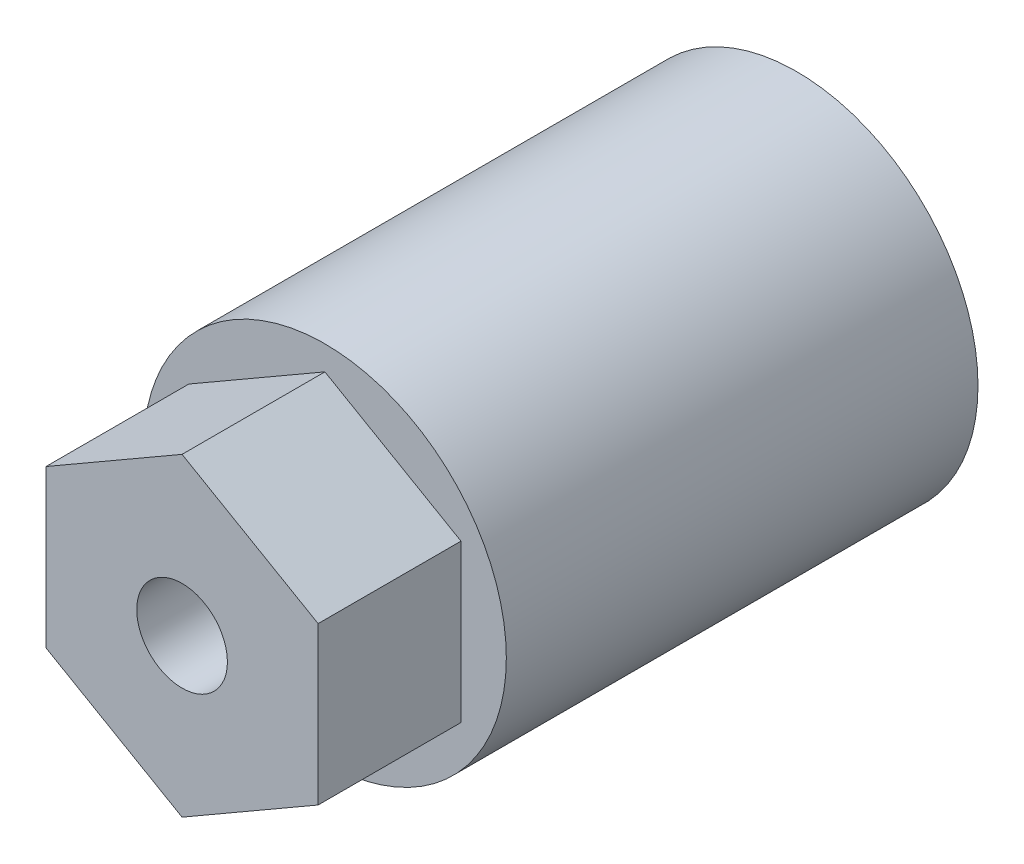
ISO-10303-21;
HEADER;
FILE_DESCRIPTION(('STEP AP214'),'2;1');
FILE_NAME('part.step','',(''),(''),'','','');
FILE_SCHEMA(('AUTOMOTIVE_DESIGN { 1 0 10303 214 1 1 1 1 }'));
ENDSEC;
DATA;
#1=APPLICATION_CONTEXT('core data for automotive mechanical design processes');
#2=APPLICATION_PROTOCOL_DEFINITION('international standard','automotive_design',2000,#1);
#3=PRODUCT_CONTEXT('',#1,'mechanical');
#4=PRODUCT('Part','Part','',(#3));
#5=PRODUCT_RELATED_PRODUCT_CATEGORY('part','',(#4));
#6=PRODUCT_DEFINITION_FORMATION('','',#4);
#7=PRODUCT_DEFINITION_CONTEXT('part definition',#1,'design');
#8=PRODUCT_DEFINITION('design','',#6,#7);
#9=PRODUCT_DEFINITION_SHAPE('','',#8);
#10=(LENGTH_UNIT() NAMED_UNIT(*) SI_UNIT(.MILLI.,.METRE.));
#11=(NAMED_UNIT(*) PLANE_ANGLE_UNIT() SI_UNIT($,.RADIAN.));
#12=(NAMED_UNIT(*) SI_UNIT($,.STERADIAN.) SOLID_ANGLE_UNIT());
#13=UNCERTAINTY_MEASURE_WITH_UNIT(LENGTH_MEASURE(1.E-05),#10,'distance_accuracy_value','');
#14=(GEOMETRIC_REPRESENTATION_CONTEXT(3) GLOBAL_UNCERTAINTY_ASSIGNED_CONTEXT((#13)) GLOBAL_UNIT_ASSIGNED_CONTEXT((#10,
#11,#12)) REPRESENTATION_CONTEXT('',''));
#15=CARTESIAN_POINT('',(0.,0.,0.));
#16=DIRECTION('',(0.,0.,1.));
#17=DIRECTION('',(1.,0.,0.));
#18=AXIS2_PLACEMENT_3D('',#15,#16,#17);
#19=CARTESIAN_POINT('',(0.,0.,20.8));
#20=DIRECTION('',(0.,0.,1.));
#21=DIRECTION('',(1.,0.,0.));
#22=AXIS2_PLACEMENT_3D('',#19,#20,#21);
#23=PLANE('',#22);
#24=CARTESIAN_POINT('',(0.,0.,20.8));
#25=DIRECTION('',(0.,0.,1.));
#26=DIRECTION('',(1.,0.,0.));
#27=AXIS2_PLACEMENT_3D('',#24,#25,#26);
#28=CIRCLE('',#27,8.);
#29=CARTESIAN_POINT('',(8.,0.,20.8));
#30=VERTEX_POINT('',#29);
#31=EDGE_CURVE('E11',#30,#30,#28,.T.);
#32=ORIENTED_EDGE('',*,*,#31,.T.);
#33=EDGE_LOOP('',(#32));
#34=FACE_BOUND('',#33,.T.);
#35=DIRECTION('',(-0.866025403784439,-0.5,0.));
#36=VECTOR('',#35,1.);
#37=CARTESIAN_POINT('',(0.,6.92820323027551,20.8));
#38=LINE('',#37,#36);
#39=CARTESIAN_POINT('',(0.,6.92820323027551,20.8));
#40=VERTEX_POINT('',#39);
#41=CARTESIAN_POINT('',(-6.,3.46410161513776,20.8));
#42=VERTEX_POINT('',#41);
#43=EDGE_CURVE('E118',#40,#42,#38,.T.);
#44=ORIENTED_EDGE('',*,*,#43,.F.);
#45=DIRECTION('',(-0.866025403784439,0.5,0.));
#46=VECTOR('',#45,1.);
#47=CARTESIAN_POINT('',(6.,3.46410161513776,20.8));
#48=LINE('',#47,#46);
#49=CARTESIAN_POINT('',(6.,3.46410161513776,20.8));
#50=VERTEX_POINT('',#49);
#51=EDGE_CURVE('E115',#50,#40,#48,.T.);
#52=ORIENTED_EDGE('',*,*,#51,.F.);
#53=DIRECTION('',(0.,1.,0.));
#54=VECTOR('',#53,1.);
#55=CARTESIAN_POINT('',(6.,-3.46410161513775,20.8));
#56=LINE('',#55,#54);
#57=CARTESIAN_POINT('',(6.,-3.46410161513775,20.8));
#58=VERTEX_POINT('',#57);
#59=EDGE_CURVE('E73',#58,#50,#56,.T.);
#60=ORIENTED_EDGE('',*,*,#59,.F.);
#61=DIRECTION('',(0.866025403784439,0.5,0.));
#62=VECTOR('',#61,1.);
#63=CARTESIAN_POINT('',(0.,-6.92820323027551,20.8));
#64=LINE('',#63,#62);
#65=CARTESIAN_POINT('',(0.,-6.92820323027551,20.8));
#66=VERTEX_POINT('',#65);
#67=EDGE_CURVE('E124',#66,#58,#64,.T.);
#68=ORIENTED_EDGE('',*,*,#67,.F.);
#69=DIRECTION('',(0.866025403784439,-0.5,0.));
#70=VECTOR('',#69,1.);
#71=CARTESIAN_POINT('',(-6.,-3.46410161513775,20.8));
#72=LINE('',#71,#70);
#73=CARTESIAN_POINT('',(-6.,-3.46410161513775,20.8));
#74=VERTEX_POINT('',#73);
#75=EDGE_CURVE('E104',#74,#66,#72,.T.);
#76=ORIENTED_EDGE('',*,*,#75,.F.);
#77=DIRECTION('',(0.,-1.,0.));
#78=VECTOR('',#77,1.);
#79=CARTESIAN_POINT('',(-6.,3.46410161513776,20.8));
#80=LINE('',#79,#78);
#81=EDGE_CURVE('E121',#42,#74,#80,.T.);
#82=ORIENTED_EDGE('',*,*,#81,.F.);
#83=EDGE_LOOP('',(#44,#52,#60,#68,#76,#82));
#84=FACE_BOUND('',#83,.T.);
#85=ADVANCED_FACE('F30',(#34,#84),#23,.T.);
#86=CARTESIAN_POINT('',(0.,0.,20.8));
#87=DIRECTION('',(0.,0.,-1.));
#88=DIRECTION('',(-1.,0.,0.));
#89=AXIS2_PLACEMENT_3D('',#86,#87,#88);
#90=CYLINDRICAL_SURFACE('',#89,3.1);
#91=CARTESIAN_POINT('',(-3.1,0.,3.5));
#92=CARTESIAN_POINT('',(-3.09999001335381,-0.119778360676659,3.50001028148365));
#93=CARTESIAN_POINT('',(-3.09298899770045,-0.239689539985006,3.50867740049262));
#94=CARTESIAN_POINT('',(-3.06560951820483,-0.475617759933917,3.54275354772049));
#95=CARTESIAN_POINT('',(-3.04520791212676,-0.591627698312463,3.56819153878806));
#96=CARTESIAN_POINT('',(-2.9929494019227,-0.815730353912269,3.63396063484863));
#97=CARTESIAN_POINT('',(-2.96116388784221,-0.923867467554761,3.67419896641728));
#98=CARTESIAN_POINT('',(-2.88841373293041,-1.13099059708294,3.76756032693233));
#99=CARTESIAN_POINT('',(-2.84744794143697,-1.22997546362095,3.82068497112667));
#100=CARTESIAN_POINT('',(-2.74309892139905,-1.45090450952975,3.95860328742459));
#101=CARTESIAN_POINT('',(-2.67690087487705,-1.56866360440175,4.04796183868125));
#102=CARTESIAN_POINT('',(-2.53775821079263,-1.7850404255772,4.24357894520806));
#103=CARTESIAN_POINT('',(-2.46479460442876,-1.88360171240231,4.34988570870426));
#104=CARTESIAN_POINT('',(-2.35456527658012,-2.017286965089,4.52151631947274));
#105=CARTESIAN_POINT('',(-2.31738149085423,-2.05977934340619,4.58129992553594));
#106=CARTESIAN_POINT('',(-2.24389548090978,-2.13959589417189,4.70480110486757));
#107=CARTESIAN_POINT('',(-2.20759354335433,-2.17691840410622,4.76851993413571));
#108=CARTESIAN_POINT('',(-2.13716872606198,-2.24609423898418,4.89975126501393));
#109=CARTESIAN_POINT('',(-2.10304023438918,-2.27796204037355,4.96725307355054));
#110=CARTESIAN_POINT('',(-2.03837958481211,-2.33599958602125,5.10625838105639));
#111=CARTESIAN_POINT('',(-2.00784434920913,-2.36217422314001,5.17775837689831));
#112=CARTESIAN_POINT('',(-1.94837498628516,-2.41154065035239,5.33504336983782));
#113=CARTESIAN_POINT('',(-1.92024755256826,-2.43381803587642,5.42143574444143));
#114=CARTESIAN_POINT('',(-1.87451159448019,-2.46922213667887,5.59866772098612));
#115=CARTESIAN_POINT('',(-1.85687697622378,-2.48237156536743,5.68949567787761));
#116=CARTESIAN_POINT('',(-1.83500569313484,-2.49859247783835,5.87461738874309));
#117=CARTESIAN_POINT('',(-1.83089546359108,-2.50156886697938,5.96893555887658));
#118=CARTESIAN_POINT('',(-1.83732153085888,-2.49684928962182,6.1568259440256));
#119=CARTESIAN_POINT('',(-1.84786859391861,-2.48914547818581,6.25039755988168));
#120=CARTESIAN_POINT('',(-1.88391546736506,-2.46199489218825,6.44702234195062));
#121=CARTESIAN_POINT('',(-1.91135892816041,-2.44100955585001,6.54948705969592));
#122=CARTESIAN_POINT('',(-1.97745021574095,-2.38777531233997,6.74775503009025));
#123=CARTESIAN_POINT('',(-2.01613187508474,-2.35549233272118,6.84353706850858));
#124=CARTESIAN_POINT('',(-2.08976487157298,-2.29012853184197,7.00546278977321));
#125=CARTESIAN_POINT('',(-2.12332131477706,-2.25916672321896,7.0731333329522));
#126=CARTESIAN_POINT('',(-2.19268911692417,-2.19190662653042,7.20457297739353));
#127=CARTESIAN_POINT('',(-2.22850156493576,-2.15560574960943,7.26834016459819));
#128=CARTESIAN_POINT('',(-2.3375286609731,-2.03893319943357,7.45401664591901));
#129=CARTESIAN_POINT('',(-2.41230832480796,-1.95081223232775,7.57025070756857));
#130=CARTESIAN_POINT('',(-2.56083494886911,-1.75160111169682,7.79012948722995));
#131=CARTESIAN_POINT('',(-2.63448052560473,-1.63989136012433,7.89328097039917));
#132=CARTESIAN_POINT('',(-2.77154829394836,-1.39570626530501,8.0797717240555));
#133=CARTESIAN_POINT('',(-2.83499703716061,-1.26328668498952,8.16316272708942));
#134=CARTESIAN_POINT('',(-2.92949524106006,-1.01979463227478,8.28538194470123));
#135=CARTESIAN_POINT('',(-2.96463246261837,-0.913281538338363,8.33014295899967));
#136=CARTESIAN_POINT('',(-3.02386567643609,-0.692299383436477,8.40505608152619));
#137=CARTESIAN_POINT('',(-3.04796987506065,-0.577836308895644,8.43521904874611));
#138=CARTESIAN_POINT('',(-3.08324545183139,-0.34314084571492,8.47922918050984));
#139=CARTESIAN_POINT('',(-3.09434390591335,-0.222879825409671,8.49298435310288));
#140=CARTESIAN_POINT('',(-3.1022974998994,0.0188325356493559,8.50285038306527));
#141=CARTESIAN_POINT('',(-3.09915629445998,0.140283562999878,8.49896576774505));
#142=CARTESIAN_POINT('',(-3.07985111492542,0.369592159693093,8.47497973113724));
#143=CARTESIAN_POINT('',(-3.06485327605492,0.477707829230698,8.45633025016811));
#144=CARTESIAN_POINT('',(-3.02443626838147,0.688719557586174,8.4057112095014));
#145=CARTESIAN_POINT('',(-2.99901424030674,0.791614175602715,8.37373799517109));
#146=CARTESIAN_POINT('',(-2.93781657584416,0.995582572846002,8.29594741604706));
#147=CARTESIAN_POINT('',(-2.90155557352613,1.09625730275886,8.24947515235124));
#148=CARTESIAN_POINT('',(-2.82155077559663,1.28828745868955,8.14528835497947));
#149=CARTESIAN_POINT('',(-2.77780631007413,1.37964204920942,8.08757281475407));
#150=CARTESIAN_POINT('',(-2.67639841656326,1.5685751007912,7.95079494403796));
#151=CARTESIAN_POINT('',(-2.6176603588023,1.66413998612004,7.86975889351471));
#152=CARTESIAN_POINT('',(-2.49626806764123,1.84124673515975,7.69566732695565));
#153=CARTESIAN_POINT('',(-2.43360410084937,1.92275170041104,7.602581273822));
#154=CARTESIAN_POINT('',(-2.33292149755606,2.0423019501302,7.44383811487991));
#155=CARTESIAN_POINT('',(-2.2948094629046,2.0849103113265,7.3816180351288));
#156=CARTESIAN_POINT('',(-2.21975309444715,2.1646455380106,7.25301193659697));
#157=CARTESIAN_POINT('',(-2.18280935479017,2.2017696485683,7.18662384777934));
#158=CARTESIAN_POINT('',(-2.11156599968842,2.27018074659443,7.04981522138375));
#159=CARTESIAN_POINT('',(-2.07725930257227,2.30148371250482,6.97940643691333));
#160=CARTESIAN_POINT('',(-2.01293979676536,2.35794450749181,6.83435448256897));
#161=CARTESIAN_POINT('',(-1.98292225025443,2.38310913908663,6.75971611405686));
#162=CARTESIAN_POINT('',(-1.92703802029426,2.42856624200181,6.59963108295032));
#163=CARTESIAN_POINT('',(-1.90174280150121,2.44826102065036,6.51380533858212));
#164=CARTESIAN_POINT('',(-1.86203047167624,2.47860518959247,6.33824484581172));
#165=CARTESIAN_POINT('',(-1.84758432915324,2.48927872987158,6.24852121431641));
#166=CARTESIAN_POINT('',(-1.83198973066466,2.50078489626993,6.0665425174808));
#167=CARTESIAN_POINT('',(-1.83094108349744,2.50154366013723,5.9742735782176));
#168=CARTESIAN_POINT('',(-1.84262322053153,2.49294583035613,5.79104623753692));
#169=CARTESIAN_POINT('',(-1.8553712786061,2.48357655612899,5.70008962382471));
#170=CARTESIAN_POINT('',(-1.89618640153277,2.45259921802398,5.50333197602627));
#171=CARTESIAN_POINT('',(-1.92691938765144,2.42882492610552,5.39845101442106));
#172=CARTESIAN_POINT('',(-1.99936028699355,2.36954227385472,5.19596278042123));
#173=CARTESIAN_POINT('',(-2.04110111187003,2.33399864225652,5.09837846606305));
#174=CARTESIAN_POINT('',(-2.11940167638023,2.26278696499334,4.93433183973946));
#175=CARTESIAN_POINT('',(-2.15463003859835,2.22939184189949,4.86620821230552));
#176=CARTESIAN_POINT('',(-2.22703059559933,2.15707029651434,4.73401056571578));
#177=CARTESIAN_POINT('',(-2.26420367592479,2.1181413402474,4.66993842128609));
#178=CARTESIAN_POINT('',(-2.33930273605632,2.03489715163424,4.54577149290103));
#179=CARTESIAN_POINT('',(-2.37722927468899,1.99057778625372,4.48567981614638));
#180=CARTESIAN_POINT('',(-2.45281816939318,1.89666309949984,4.36958517047597));
#181=CARTESIAN_POINT('',(-2.49048037968546,1.84706507852289,4.31358431861243));
#182=CARTESIAN_POINT('',(-2.60338878677403,1.68802975013425,4.14957914374343));
#183=CARTESIAN_POINT('',(-2.67689336802577,1.57010426927428,4.04820966851992));
#184=CARTESIAN_POINT('',(-2.77806294552149,1.37755009978862,3.91229408369595));
#185=CARTESIAN_POINT('',(-2.81025494891813,1.31079924420425,3.86969944245975));
#186=CARTESIAN_POINT('',(-2.87080763913606,1.17224885881743,3.79043049934866));
#187=CARTESIAN_POINT('',(-2.89917040151468,1.10045209639154,3.75375298810251));
#188=CARTESIAN_POINT('',(-2.96115028124245,0.923785635516078,3.67422084599394));
#189=CARTESIAN_POINT('',(-2.99262693015815,0.816770664538932,3.63437042748585));
#190=CARTESIAN_POINT('',(-3.04428396421388,0.59592432288367,3.56935048078989));
#191=CARTESIAN_POINT('',(-3.06449047589921,0.482109400389084,3.54414699219844));
#192=CARTESIAN_POINT('',(-3.08545620159964,0.306066119073141,3.51805233135377));
#193=CARTESIAN_POINT('',(-3.09089438398327,0.245195500229957,3.51129842402836));
#194=CARTESIAN_POINT('',(-3.09816930782587,0.12289500560308,3.5022690454876));
#195=CARTESIAN_POINT('',(-3.1000051247079,0.0614649903089401,3.49999472399447));
#196=CARTESIAN_POINT('',(-3.1,0.,3.5));
#197=B_SPLINE_CURVE_WITH_KNOTS('',3,(#91,#92,#93,#94,#95,#96,#97,#98,#99,#100,#101,#102,#103,
#104,#105,#106,#107,#108,#109,#110,#111,#112,#113,#114,#115,#116,#117,#118,#119,#120,#121,#122,
#123,#124,#125,#126,#127,#128,#129,#130,#131,#132,#133,#134,#135,#136,#137,#138,#139,#140,#141,
#142,#143,#144,#145,#146,#147,#148,#149,#150,#151,#152,#153,#154,#155,#156,#157,#158,#159,#160,
#161,#162,#163,#164,#165,#166,#167,#168,#169,#170,#171,#172,#173,#174,#175,#176,#177,#178,#179,
#180,#181,#182,#183,#184,#185,#186,#187,#188,#189,#190,#191,#192,#193,#194,#195,#196),
.UNSPECIFIED.,.T.,.F.,(4,2,2,2,2,2,2,2,2,2,2,2,2,2,2,2,2,2,2,2,2,2,2,2,2,2,2,2,2,2,2,2,2,2,2,2,
2,2,2,2,2,2,2,2,2,2,2,2,2,2,2,2,4),(0.,0.359070623022655,0.718762981506723,1.07623806013682,
1.43375797001857,1.91714127370146,2.40192490534894,2.64841768811481,2.89498955433995,
3.14089653182535,3.38659132770226,3.66629544495804,3.94530104553679,4.22690768112856,
4.50872127512767,4.83133279215932,5.15492577621902,5.39951634126531,5.64422589899106,
6.1338217571336,6.63837846963134,7.14159929676523,7.50245315539382,7.86303817292729,
8.22563548450796,8.58813973953903,8.91885561645134,9.24966226683066,9.59834994649167,
9.94706885662276,10.3607838797144,10.7755686514586,11.028808623269,11.2821753768965,
11.5348360542378,11.7872154471329,12.0610951823722,12.3342393942177,12.6094173021897,
12.8849401398458,13.2186306545198,13.5533303889098,13.8039756020852,14.0547359591548,
14.305689810481,14.5567726267162,15.0695565026576,15.3256405009352,15.5815851323227,
15.9354380765006,16.2884672690008,16.4726792578371,16.6569385200247),.UNSPECIFIED.);
#198=CARTESIAN_POINT('',(-3.1,0.,3.5));
#199=VERTEX_POINT('',#198);
#200=EDGE_CURVE('E208',#199,#199,#197,.T.);
#201=ORIENTED_EDGE('',*,*,#200,.T.);
#202=EDGE_LOOP('',(#201));
#203=FACE_BOUND('',#202,.T.);
#204=CARTESIAN_POINT('',(0.,0.,0.));
#205=DIRECTION('',(0.,0.,1.));
#206=DIRECTION('',(1.,0.,0.));
#207=AXIS2_PLACEMENT_3D('',#204,#205,#206);
#208=CIRCLE('',#207,3.1);
#209=CARTESIAN_POINT('',(3.1,0.,0.));
#210=VERTEX_POINT('',#209);
#211=EDGE_CURVE('E142',#210,#210,#208,.T.);
#212=ORIENTED_EDGE('',*,*,#211,.F.);
#213=EDGE_LOOP('',(#212));
#214=FACE_BOUND('',#213,.T.);
#215=CARTESIAN_POINT('',(0.,0.,18.6));
#216=DIRECTION('',(0.,0.,1.));
#217=DIRECTION('',(1.,0.,0.));
#218=AXIS2_PLACEMENT_3D('',#215,#216,#217);
#219=CIRCLE('',#218,3.1);
#220=CARTESIAN_POINT('',(3.1,0.,18.6));
#221=VERTEX_POINT('',#220);
#222=EDGE_CURVE('E139',#221,#221,#219,.T.);
#223=ORIENTED_EDGE('',*,*,#222,.T.);
#224=EDGE_LOOP('',(#223));
#225=FACE_BOUND('',#224,.T.);
#226=ADVANCED_FACE('F152',(#203,#214,#225),#90,.F.);
#227=CARTESIAN_POINT('',(0.,0.,0.));
#228=DIRECTION('',(0.,0.,1.));
#229=DIRECTION('',(1.,0.,0.));
#230=AXIS2_PLACEMENT_3D('',#227,#228,#229);
#231=PLANE('',#230);
#232=CARTESIAN_POINT('',(0.,0.,0.));
#233=DIRECTION('',(0.,0.,1.));
#234=DIRECTION('',(1.,0.,0.));
#235=AXIS2_PLACEMENT_3D('',#232,#233,#234);
#236=CIRCLE('',#235,8.);
#237=CARTESIAN_POINT('',(8.,0.,0.));
#238=VERTEX_POINT('',#237);
#239=EDGE_CURVE('E34',#238,#238,#236,.T.);
#240=ORIENTED_EDGE('',*,*,#239,.F.);
#241=EDGE_LOOP('',(#240));
#242=FACE_BOUND('',#241,.T.);
#243=ORIENTED_EDGE('',*,*,#211,.T.);
#244=EDGE_LOOP('',(#243));
#245=FACE_BOUND('',#244,.T.);
#246=ADVANCED_FACE('F150',(#242,#245),#231,.F.);
#247=CARTESIAN_POINT('',(0.,0.,20.8));
#248=DIRECTION('',(0.,0.,-1.));
#249=DIRECTION('',(-1.,0.,0.));
#250=AXIS2_PLACEMENT_3D('',#247,#248,#249);
#251=CYLINDRICAL_SURFACE('',#250,8.);
#252=CARTESIAN_POINT('',(-8.,0.,3.5));
#253=CARTESIAN_POINT('',(-7.9999993175598,-0.136878370349093,3.50000089317515));
#254=CARTESIAN_POINT('',(-7.99645389969682,-0.273766105005719,3.51127845388891));
#255=CARTESIAN_POINT('',(-7.98265788177613,-0.543538419176897,3.55597248307847));
#256=CARTESIAN_POINT('',(-7.97240576399719,-0.676422085451815,3.58939396272872));
#257=CARTESIAN_POINT('',(-7.94631631395819,-0.934257087301613,3.67713874239148));
#258=CARTESIAN_POINT('',(-7.9304876299805,-1.05922035397161,3.73142968930593));
#259=CARTESIAN_POINT('',(-7.89487938322185,-1.29826960469292,3.85923463535666));
#260=CARTESIAN_POINT('',(-7.8750991979981,-1.41235387088977,3.93275166356117));
#261=CARTESIAN_POINT('',(-7.83300427480565,-1.62993066990456,4.09931198403472));
#262=CARTESIAN_POINT('',(-7.81063431853978,-1.73304005631332,4.19284177012214));
#263=CARTESIAN_POINT('',(-7.76620092748417,-1.92239476407399,4.3957367848271));
#264=CARTESIAN_POINT('',(-7.74413755046914,-2.00863694579739,4.5051049549891));
#265=CARTESIAN_POINT('',(-7.70222289396344,-2.16388672966227,4.73988912761617));
#266=CARTESIAN_POINT('',(-7.68243976603591,-2.23241568300258,4.86563495505444));
#267=CARTESIAN_POINT('',(-7.64815603598468,-2.34719482153343,5.12758462996375));
#268=CARTESIAN_POINT('',(-7.63365404257377,-2.39345087543889,5.26378571158786));
#269=CARTESIAN_POINT('',(-7.61215213969001,-2.46096919860067,5.53845615490413));
#270=CARTESIAN_POINT('',(-7.60493945859016,-2.48294220015729,5.67673368727771));
#271=CARTESIAN_POINT('',(-7.59820110281901,-2.50349110073976,5.95518623782379));
#272=CARTESIAN_POINT('',(-7.59867338454668,-2.50207321991544,6.09536074164332));
#273=CARTESIAN_POINT('',(-7.60706378150876,-2.47643649465479,6.36774892053797));
#274=CARTESIAN_POINT('',(-7.61468683491897,-2.45312115738766,6.50005825172313));
#275=CARTESIAN_POINT('',(-7.63604051304978,-2.38581626711252,6.75878431307469));
#276=CARTESIAN_POINT('',(-7.6497717868623,-2.34182451689101,6.8852004154176));
#277=CARTESIAN_POINT('',(-7.68202088028593,-2.23377749362554,7.13070388886527));
#278=CARTESIAN_POINT('',(-7.70060569321649,-2.16943851324164,7.24965722138397));
#279=CARTESIAN_POINT('',(-7.7404371316014,-2.02272041475696,7.47537553575825));
#280=CARTESIAN_POINT('',(-7.76168444789102,-1.94033661043155,7.58213734050743));
#281=CARTESIAN_POINT('',(-7.80563055600986,-1.75543390836425,7.78554988683398));
#282=CARTESIAN_POINT('',(-7.82835139211391,-1.65216914118564,7.88151911555937));
#283=CARTESIAN_POINT('',(-7.87183141519161,-1.43072881619106,8.05494378715936));
#284=CARTESIAN_POINT('',(-7.89259045676745,-1.31255215469804,8.13239785843842));
#285=CARTESIAN_POINT('',(-7.93002589780382,-1.06332922093091,8.26705537720255));
#286=CARTESIAN_POINT('',(-7.94666921296415,-0.932189813838559,8.32409627092794));
#287=CARTESIAN_POINT('',(-7.97375911657108,-0.661535955565289,8.41510600170313));
#288=CARTESIAN_POINT('',(-7.98420758650304,-0.522024061449217,8.44908184447679));
#289=CARTESIAN_POINT('',(-7.99742778790027,-0.24437031458069,8.49183608515796));
#290=CARTESIAN_POINT('',(-8.00048045790873,-0.106383697577686,8.50153708718705));
#291=CARTESIAN_POINT('',(-7.99939599461967,0.169260611465171,8.49806754672534));
#292=CARTESIAN_POINT('',(-7.9952599116227,0.306918348613018,8.48490034535478));
#293=CARTESIAN_POINT('',(-7.98044727539523,0.574438665951697,8.43680881478723));
#294=CARTESIAN_POINT('',(-7.96993586221374,0.704409956841872,8.40243346477503));
#295=CARTESIAN_POINT('',(-7.94360242758579,0.956703857722752,8.31357129526657));
#296=CARTESIAN_POINT('',(-7.92777975028687,1.07902552089812,8.25908199194998));
#297=CARTESIAN_POINT('',(-7.89197085518848,1.31586481334438,8.13005356690263));
#298=CARTESIAN_POINT('',(-7.87189253635335,1.43011947957558,8.05505802500638));
#299=CARTESIAN_POINT('',(-7.82986820006859,1.64473170192052,7.88769357976515));
#300=CARTESIAN_POINT('',(-7.80792167695774,1.7450854760879,7.79531996451072));
#301=CARTESIAN_POINT('',(-7.76353989766283,1.93317492583804,7.5914822198958));
#302=CARTESIAN_POINT('',(-7.74111973412883,2.02025304679062,7.47940667252155));
#303=CARTESIAN_POINT('',(-7.69923894191212,2.17442500490303,7.24174676724645));
#304=CARTESIAN_POINT('',(-7.67977826622621,2.24151915946859,7.11616262394603));
#305=CARTESIAN_POINT('',(-7.64623564661738,2.35340166961084,6.85530965425905));
#306=CARTESIAN_POINT('',(-7.63213292713749,2.39827639112025,6.72008070112856));
#307=CARTESIAN_POINT('',(-7.6110234168862,2.4644578863618,6.44345501350276));
#308=CARTESIAN_POINT('',(-7.60401392602456,2.48577362827989,6.30206064731293));
#309=CARTESIAN_POINT('',(-7.59816585427753,2.50358812316251,6.02399182483914));
#310=CARTESIAN_POINT('',(-7.59897209200284,2.50116559243271,5.88739309230516));
#311=CARTESIAN_POINT('',(-7.60780180751807,2.47417636257668,5.61665083011612));
#312=CARTESIAN_POINT('',(-7.61582494863208,2.44961069645024,5.48250718622653));
#313=CARTESIAN_POINT('',(-7.6379362836678,2.37975459827235,5.22241192081622));
#314=CARTESIAN_POINT('',(-7.65193396380513,2.33477284812016,5.09636911781328));
#315=CARTESIAN_POINT('',(-7.68439408509128,2.22560454669999,4.85351917293199));
#316=CARTESIAN_POINT('',(-7.70285743429343,2.16141408888474,4.73671391584319));
#317=CARTESIAN_POINT('',(-7.74306974067005,2.01271350026986,4.51070805912037));
#318=CARTESIAN_POINT('',(-7.76491897845913,1.92750667048265,4.40198374099952));
#319=CARTESIAN_POINT('',(-7.8089799764242,1.7404179928096,4.200027343776));
#320=CARTESIAN_POINT('',(-7.83119183213309,1.63853168468878,4.10679942201788));
#321=CARTESIAN_POINT('',(-7.87434543904947,1.41697332564669,3.93543492327414));
#322=CARTESIAN_POINT('',(-7.89522203461345,1.29682914897477,3.8578905271001));
#323=CARTESIAN_POINT('',(-7.93253538593756,1.0445582760273,3.72420216972109));
#324=CARTESIAN_POINT('',(-7.94897388631644,0.912436315590896,3.66804979571633));
#325=CARTESIAN_POINT('',(-7.97441301466941,0.651495270747956,3.58281726478307));
#326=CARTESIAN_POINT('',(-7.98392481612283,0.523340674225092,3.55185026538933));
#327=CARTESIAN_POINT('',(-7.99671800680967,0.263459790880495,3.51044328006457));
#328=CARTESIAN_POINT('',(-8.00000065679286,0.131734232279349,3.49999914039199));
#329=CARTESIAN_POINT('',(-8.,0.,3.5));
#330=B_SPLINE_CURVE_WITH_KNOTS('',3,(#252,#253,#254,#255,#256,#257,#258,#259,#260,#261,#262,
#263,#264,#265,#266,#267,#268,#269,#270,#271,#272,#273,#274,#275,#276,#277,#278,#279,#280,#281,
#282,#283,#284,#285,#286,#287,#288,#289,#290,#291,#292,#293,#294,#295,#296,#297,#298,#299,#300,
#301,#302,#303,#304,#305,#306,#307,#308,#309,#310,#311,#312,#313,#314,#315,#316,#317,#318,#319,
#320,#321,#322,#323,#324,#325,#326,#327,#328,#329),.UNSPECIFIED.,.T.,.F.,(4,2,2,2,2,2,2,2,2,2,2,
2,2,2,2,2,2,2,2,2,2,2,2,2,2,2,2,2,2,2,2,2,2,2,2,2,2,2,4),(0.,0.41015089886502,0.820394646698133,
1.23000495840487,1.63967984311678,2.06075644390317,2.48191134862552,2.91347542494988,
3.34492572559054,3.7633830033442,4.18172900590277,4.58353834844338,4.98539039958126,
5.3931128544109,5.80094132020717,6.227334945592,6.65376014826606,7.0835092137954,
7.51312768989108,7.92615137096475,8.33911471298726,8.74181253445744,9.14456010068999,
9.55712649476686,9.96980491418519,10.3988355742628,10.8278594196742,11.2552023150671,
11.6823824779468,12.0902440696666,12.4980866352126,12.8999582681244,13.3019116867944,
13.7195902803182,14.1373807476578,14.5688133627192,15.0000761335177,15.3948927332218,
15.7896294154519),.UNSPECIFIED.);
#331=CARTESIAN_POINT('',(-8.,0.,3.5));
#332=VERTEX_POINT('',#331);
#333=EDGE_CURVE('E204',#332,#332,#330,.T.);
#334=ORIENTED_EDGE('',*,*,#333,.F.);
#335=EDGE_LOOP('',(#334));
#336=FACE_BOUND('',#335,.T.);
#337=ORIENTED_EDGE('',*,*,#31,.F.);
#338=EDGE_LOOP('',(#337));
#339=FACE_BOUND('',#338,.T.);
#340=ORIENTED_EDGE('',*,*,#239,.T.);
#341=EDGE_LOOP('',(#340));
#342=FACE_BOUND('',#341,.T.);
#343=ADVANCED_FACE('F32',(#336,#339,#342),#251,.T.);
#344=CARTESIAN_POINT('',(0.,0.,18.6));
#345=DIRECTION('',(0.,0.,1.));
#346=DIRECTION('',(1.,0.,0.));
#347=AXIS2_PLACEMENT_3D('',#344,#345,#346);
#348=PLANE('',#347);
#349=CARTESIAN_POINT('',(0.,0.,18.6));
#350=DIRECTION('',(0.,0.,1.));
#351=DIRECTION('',(1.,0.,0.));
#352=AXIS2_PLACEMENT_3D('',#349,#350,#351);
#353=CIRCLE('',#352,2.);
#354=CARTESIAN_POINT('',(2.,0.,18.6));
#355=VERTEX_POINT('',#354);
#356=EDGE_CURVE('E136',#355,#355,#353,.T.);
#357=ORIENTED_EDGE('',*,*,#356,.T.);
#358=EDGE_LOOP('',(#357));
#359=FACE_BOUND('',#358,.T.);
#360=ORIENTED_EDGE('',*,*,#222,.F.);
#361=EDGE_LOOP('',(#360));
#362=FACE_BOUND('',#361,.T.);
#363=ADVANCED_FACE('F157',(#359,#362),#348,.F.);
#364=CARTESIAN_POINT('',(0.,0.,18.6));
#365=DIRECTION('',(0.,0.,1.));
#366=DIRECTION('',(1.,0.,0.));
#367=AXIS2_PLACEMENT_3D('',#364,#365,#366);
#368=CYLINDRICAL_SURFACE('',#367,2.);
#369=ORIENTED_EDGE('',*,*,#356,.F.);
#370=EDGE_LOOP('',(#369));
#371=FACE_BOUND('',#370,.T.);
#372=CARTESIAN_POINT('',(0.,0.,27.1));
#373=DIRECTION('',(0.,0.,1.));
#374=DIRECTION('',(1.,0.,0.));
#375=AXIS2_PLACEMENT_3D('',#372,#373,#374);
#376=CIRCLE('',#375,2.);
#377=CARTESIAN_POINT('',(2.,0.,27.1));
#378=VERTEX_POINT('',#377);
#379=EDGE_CURVE('E119',#378,#378,#376,.T.);
#380=ORIENTED_EDGE('',*,*,#379,.T.);
#381=EDGE_LOOP('',(#380));
#382=FACE_BOUND('',#381,.T.);
#383=ADVANCED_FACE('F170',(#371,#382),#368,.F.);
#384=CARTESIAN_POINT('',(0.,6.92820323027551,27.1));
#385=DIRECTION('',(0.,0.,1.));
#386=DIRECTION('',(1.,0.,0.));
#387=AXIS2_PLACEMENT_3D('',#384,#385,#386);
#388=PLANE('',#387);
#389=DIRECTION('',(-0.866025403784439,0.5,0.));
#390=VECTOR('',#389,1.);
#391=CARTESIAN_POINT('',(6.,3.46410161513776,27.1));
#392=LINE('',#391,#390);
#393=CARTESIAN_POINT('',(6.,3.46410161513776,27.1));
#394=VERTEX_POINT('',#393);
#395=CARTESIAN_POINT('',(0.,6.92820323027551,27.1));
#396=VERTEX_POINT('',#395);
#397=EDGE_CURVE('E127',#394,#396,#392,.T.);
#398=ORIENTED_EDGE('',*,*,#397,.T.);
#399=DIRECTION('',(-0.866025403784439,-0.5,0.));
#400=VECTOR('',#399,1.);
#401=CARTESIAN_POINT('',(0.,6.92820323027551,27.1));
#402=LINE('',#401,#400);
#403=CARTESIAN_POINT('',(-6.,3.46410161513776,27.1));
#404=VERTEX_POINT('',#403);
#405=EDGE_CURVE('E81',#396,#404,#402,.T.);
#406=ORIENTED_EDGE('',*,*,#405,.T.);
#407=DIRECTION('',(0.,-1.,0.));
#408=VECTOR('',#407,1.);
#409=CARTESIAN_POINT('',(-6.,3.46410161513776,27.1));
#410=LINE('',#409,#408);
#411=CARTESIAN_POINT('',(-6.,-3.46410161513775,27.1));
#412=VERTEX_POINT('',#411);
#413=EDGE_CURVE('E95',#404,#412,#410,.T.);
#414=ORIENTED_EDGE('',*,*,#413,.T.);
#415=DIRECTION('',(0.866025403784439,-0.5,0.));
#416=VECTOR('',#415,1.);
#417=CARTESIAN_POINT('',(-6.,-3.46410161513775,27.1));
#418=LINE('',#417,#416);
#419=CARTESIAN_POINT('',(0.,-6.92820323027551,27.1));
#420=VERTEX_POINT('',#419);
#421=EDGE_CURVE('E88',#412,#420,#418,.T.);
#422=ORIENTED_EDGE('',*,*,#421,.T.);
#423=DIRECTION('',(0.866025403784439,0.5,0.));
#424=VECTOR('',#423,1.);
#425=CARTESIAN_POINT('',(0.,-6.92820323027551,27.1));
#426=LINE('',#425,#424);
#427=CARTESIAN_POINT('',(6.,-3.46410161513775,27.1));
#428=VERTEX_POINT('',#427);
#429=EDGE_CURVE('E93',#420,#428,#426,.T.);
#430=ORIENTED_EDGE('',*,*,#429,.T.);
#431=DIRECTION('',(0.,1.,0.));
#432=VECTOR('',#431,1.);
#433=CARTESIAN_POINT('',(6.,-3.46410161513775,27.1));
#434=LINE('',#433,#432);
#435=EDGE_CURVE('E53',#428,#394,#434,.T.);
#436=ORIENTED_EDGE('',*,*,#435,.T.);
#437=EDGE_LOOP('',(#398,#406,#414,#422,#430,#436));
#438=FACE_BOUND('',#437,.T.);
#439=ORIENTED_EDGE('',*,*,#379,.F.);
#440=EDGE_LOOP('',(#439));
#441=FACE_BOUND('',#440,.T.);
#442=ADVANCED_FACE('F90',(#438,#441),#388,.T.);
#443=CARTESIAN_POINT('',(6.,3.46410161513776,27.1));
#444=DIRECTION('',(-0.5,-0.866025403784439,0.));
#445=DIRECTION('',(0.866025403784439,-0.5,0.));
#446=AXIS2_PLACEMENT_3D('',#443,#444,#445);
#447=PLANE('',#446);
#448=ORIENTED_EDGE('',*,*,#51,.T.);
#449=DIRECTION('',(0.,0.,-1.));
#450=VECTOR('',#449,1.);
#451=CARTESIAN_POINT('',(0.,6.92820323027551,27.1));
#452=LINE('',#451,#450);
#453=EDGE_CURVE('E134',#396,#40,#452,.T.);
#454=ORIENTED_EDGE('',*,*,#453,.F.);
#455=ORIENTED_EDGE('',*,*,#397,.F.);
#456=DIRECTION('',(0.,0.,-1.));
#457=VECTOR('',#456,1.);
#458=CARTESIAN_POINT('',(6.,3.46410161513776,27.1));
#459=LINE('',#458,#457);
#460=EDGE_CURVE('E111',#394,#50,#459,.T.);
#461=ORIENTED_EDGE('',*,*,#460,.T.);
#462=EDGE_LOOP('',(#448,#454,#455,#461));
#463=FACE_BOUND('',#462,.T.);
#464=ADVANCED_FACE('F175',(#463),#447,.F.);
#465=CARTESIAN_POINT('',(0.,6.92820323027551,27.1));
#466=DIRECTION('',(0.5,-0.866025403784439,0.));
#467=DIRECTION('',(0.866025403784439,0.5,0.));
#468=AXIS2_PLACEMENT_3D('',#465,#466,#467);
#469=PLANE('',#468);
#470=ORIENTED_EDGE('',*,*,#43,.T.);
#471=DIRECTION('',(0.,0.,-1.));
#472=VECTOR('',#471,1.);
#473=CARTESIAN_POINT('',(-6.,3.46410161513776,27.1));
#474=LINE('',#473,#472);
#475=EDGE_CURVE('E131',#404,#42,#474,.T.);
#476=ORIENTED_EDGE('',*,*,#475,.F.);
#477=ORIENTED_EDGE('',*,*,#405,.F.);
#478=ORIENTED_EDGE('',*,*,#453,.T.);
#479=EDGE_LOOP('',(#470,#476,#477,#478));
#480=FACE_BOUND('',#479,.T.);
#481=ADVANCED_FACE('F178',(#480),#469,.F.);
#482=CARTESIAN_POINT('',(-6.,3.46410161513776,27.1));
#483=DIRECTION('',(1.,0.,0.));
#484=DIRECTION('',(0.,1.,0.));
#485=AXIS2_PLACEMENT_3D('',#482,#483,#484);
#486=PLANE('',#485);
#487=ORIENTED_EDGE('',*,*,#81,.T.);
#488=DIRECTION('',(0.,0.,-1.));
#489=VECTOR('',#488,1.);
#490=CARTESIAN_POINT('',(-6.,-3.46410161513775,27.1));
#491=LINE('',#490,#489);
#492=EDGE_CURVE('E107',#412,#74,#491,.T.);
#493=ORIENTED_EDGE('',*,*,#492,.F.);
#494=ORIENTED_EDGE('',*,*,#413,.F.);
#495=ORIENTED_EDGE('',*,*,#475,.T.);
#496=EDGE_LOOP('',(#487,#493,#494,#495));
#497=FACE_BOUND('',#496,.T.);
#498=ADVANCED_FACE('F182',(#497),#486,.F.);
#499=CARTESIAN_POINT('',(-6.,-3.46410161513775,27.1));
#500=DIRECTION('',(0.5,0.866025403784439,0.));
#501=DIRECTION('',(-0.866025403784439,0.5,0.));
#502=AXIS2_PLACEMENT_3D('',#499,#500,#501);
#503=PLANE('',#502);
#504=ORIENTED_EDGE('',*,*,#75,.T.);
#505=DIRECTION('',(0.,0.,-1.));
#506=VECTOR('',#505,1.);
#507=CARTESIAN_POINT('',(0.,-6.92820323027551,27.1));
#508=LINE('',#507,#506);
#509=EDGE_CURVE('E101',#420,#66,#508,.T.);
#510=ORIENTED_EDGE('',*,*,#509,.F.);
#511=ORIENTED_EDGE('',*,*,#421,.F.);
#512=ORIENTED_EDGE('',*,*,#492,.T.);
#513=EDGE_LOOP('',(#504,#510,#511,#512));
#514=FACE_BOUND('',#513,.T.);
#515=ADVANCED_FACE('F102',(#514),#503,.F.);
#516=CARTESIAN_POINT('',(0.,-6.92820323027551,27.1));
#517=DIRECTION('',(-0.5,0.866025403784439,0.));
#518=DIRECTION('',(-0.866025403784439,-0.5,0.));
#519=AXIS2_PLACEMENT_3D('',#516,#517,#518);
#520=PLANE('',#519);
#521=ORIENTED_EDGE('',*,*,#67,.T.);
#522=DIRECTION('',(0.,0.,-1.));
#523=VECTOR('',#522,1.);
#524=CARTESIAN_POINT('',(6.,-3.46410161513775,27.1));
#525=LINE('',#524,#523);
#526=EDGE_CURVE('E45',#428,#58,#525,.T.);
#527=ORIENTED_EDGE('',*,*,#526,.F.);
#528=ORIENTED_EDGE('',*,*,#429,.F.);
#529=ORIENTED_EDGE('',*,*,#509,.T.);
#530=EDGE_LOOP('',(#521,#527,#528,#529));
#531=FACE_BOUND('',#530,.T.);
#532=ADVANCED_FACE('F109',(#531),#520,.F.);
#533=CARTESIAN_POINT('',(6.,-3.46410161513775,27.1));
#534=DIRECTION('',(-1.,0.,0.));
#535=DIRECTION('',(0.,0.,1.));
#536=AXIS2_PLACEMENT_3D('',#533,#534,#535);
#537=PLANE('',#536);
#538=ORIENTED_EDGE('',*,*,#59,.T.);
#539=ORIENTED_EDGE('',*,*,#460,.F.);
#540=ORIENTED_EDGE('',*,*,#435,.F.);
#541=ORIENTED_EDGE('',*,*,#526,.T.);
#542=EDGE_LOOP('',(#538,#539,#540,#541));
#543=FACE_BOUND('',#542,.T.);
#544=ADVANCED_FACE('F190',(#543),#537,.F.);
#545=CARTESIAN_POINT('',(-8.001,0.,6.));
#546=DIRECTION('',(1.,0.,0.));
#547=DIRECTION('',(0.,0.,-1.));
#548=AXIS2_PLACEMENT_3D('',#545,#546,#547);
#549=CYLINDRICAL_SURFACE('',#548,2.5);
#550=ORIENTED_EDGE('',*,*,#200,.F.);
#551=EDGE_LOOP('',(#550));
#552=FACE_BOUND('',#551,.T.);
#553=ORIENTED_EDGE('',*,*,#333,.T.);
#554=EDGE_LOOP('',(#553));
#555=FACE_BOUND('',#554,.T.);
#556=ADVANCED_FACE('F193',(#552,#555),#549,.F.);
#557=CLOSED_SHELL('',(#85,#226,#246,#343,#363,#383,#442,#464,#481,#498,#515,#532,#544,#556));
#558=MANIFOLD_SOLID_BREP('B2',#557);
#559=ADVANCED_BREP_SHAPE_REPRESENTATION('',(#18,#558),#14);
#560=SHAPE_DEFINITION_REPRESENTATION(#9,#559);
ENDSEC;
END-ISO-10303-21;
